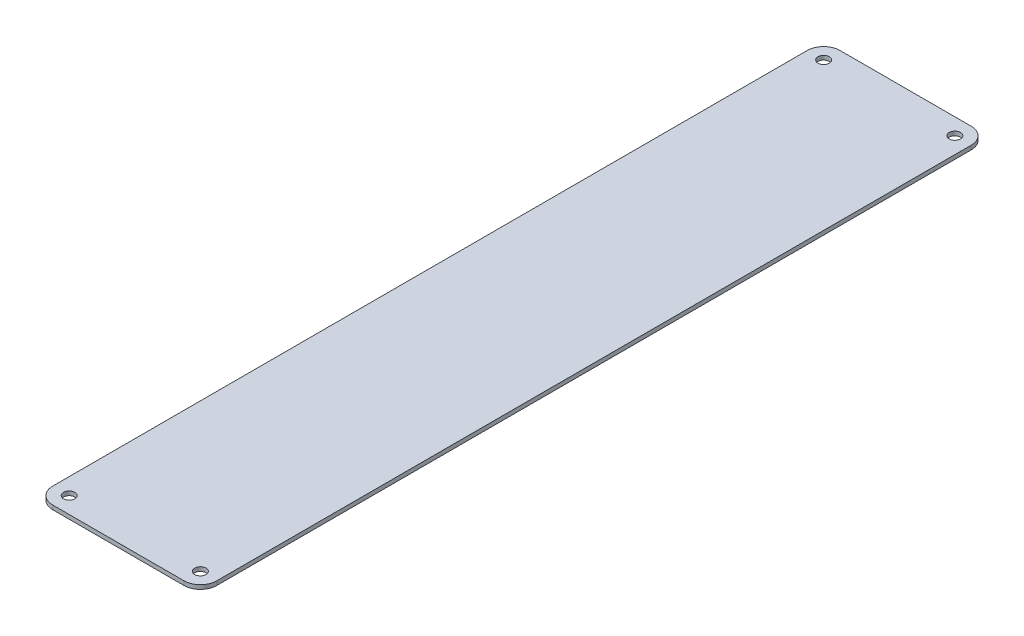
ISO-10303-21;
HEADER;
FILE_DESCRIPTION(('STEP AP214'),'2;1');
FILE_NAME('part.step','',(''),(''),'','','');
FILE_SCHEMA(('AUTOMOTIVE_DESIGN { 1 0 10303 214 1 1 1 1 }'));
ENDSEC;
DATA;
#1=APPLICATION_CONTEXT('core data for automotive mechanical design processes');
#2=APPLICATION_PROTOCOL_DEFINITION('international standard','automotive_design',2000,#1);
#3=PRODUCT_CONTEXT('',#1,'mechanical');
#4=PRODUCT('Part','Part','',(#3));
#5=PRODUCT_RELATED_PRODUCT_CATEGORY('part','',(#4));
#6=PRODUCT_DEFINITION_FORMATION('','',#4);
#7=PRODUCT_DEFINITION_CONTEXT('part definition',#1,'design');
#8=PRODUCT_DEFINITION('design','',#6,#7);
#9=PRODUCT_DEFINITION_SHAPE('','',#8);
#10=(LENGTH_UNIT() NAMED_UNIT(*) SI_UNIT(.MILLI.,.METRE.));
#11=(NAMED_UNIT(*) PLANE_ANGLE_UNIT() SI_UNIT($,.RADIAN.));
#12=(NAMED_UNIT(*) SI_UNIT($,.STERADIAN.) SOLID_ANGLE_UNIT());
#13=UNCERTAINTY_MEASURE_WITH_UNIT(LENGTH_MEASURE(1.E-05),#10,'distance_accuracy_value','');
#14=(GEOMETRIC_REPRESENTATION_CONTEXT(3) GLOBAL_UNCERTAINTY_ASSIGNED_CONTEXT((#13)) GLOBAL_UNIT_ASSIGNED_CONTEXT((#10,
#11,#12)) REPRESENTATION_CONTEXT('',''));
#15=CARTESIAN_POINT('',(0.,0.,0.));
#16=DIRECTION('',(0.,0.,1.));
#17=DIRECTION('',(1.,0.,0.));
#18=AXIS2_PLACEMENT_3D('',#15,#16,#17);
#19=CARTESIAN_POINT('',(6.35,0.79375,-298.45));
#20=DIRECTION('',(0.,1.,0.));
#21=DIRECTION('',(0.,0.,1.));
#22=AXIS2_PLACEMENT_3D('',#19,#20,#21);
#23=PLANE('',#22);
#24=CARTESIAN_POINT('',(6.35,0.79375,-6.35));
#25=DIRECTION('',(0.,1.,0.));
#26=DIRECTION('',(0.,0.,1.));
#27=AXIS2_PLACEMENT_3D('',#24,#25,#26);
#28=CIRCLE('',#27,2.1828125);
#29=CARTESIAN_POINT('',(6.35,0.79375,-4.1671875));
#30=VERTEX_POINT('',#29);
#31=EDGE_CURVE('E193',#30,#30,#28,.T.);
#32=ORIENTED_EDGE('',*,*,#31,.F.);
#33=EDGE_LOOP('',(#32));
#34=FACE_BOUND('',#33,.T.);
#35=CARTESIAN_POINT('',(57.15,0.79375,-298.45));
#36=DIRECTION('',(0.,1.,0.));
#37=DIRECTION('',(0.,0.,1.));
#38=AXIS2_PLACEMENT_3D('',#35,#36,#37);
#39=CIRCLE('',#38,2.1828125);
#40=CARTESIAN_POINT('',(57.15,0.79375,-296.2671875));
#41=VERTEX_POINT('',#40);
#42=EDGE_CURVE('E139',#41,#41,#39,.T.);
#43=ORIENTED_EDGE('',*,*,#42,.F.);
#44=EDGE_LOOP('',(#43));
#45=FACE_BOUND('',#44,.T.);
#46=CARTESIAN_POINT('',(6.35,0.79375,-298.45));
#47=DIRECTION('',(0.,1.,0.));
#48=DIRECTION('',(0.,0.,1.));
#49=AXIS2_PLACEMENT_3D('',#46,#47,#48);
#50=CIRCLE('',#49,6.35000000000001);
#51=CARTESIAN_POINT('',(6.35000000000004,0.79375,-304.8));
#52=VERTEX_POINT('',#51);
#53=CARTESIAN_POINT('',(0.,0.79375,-298.45));
#54=VERTEX_POINT('',#53);
#55=EDGE_CURVE('E150',#52,#54,#50,.T.);
#56=ORIENTED_EDGE('',*,*,#55,.T.);
#57=DIRECTION('',(0.,0.,1.));
#58=VECTOR('',#57,1.);
#59=CARTESIAN_POINT('',(0.,0.79375,-6.35000000000004));
#60=LINE('',#59,#58);
#61=CARTESIAN_POINT('',(0.,0.79375,-6.35000000000004));
#62=VERTEX_POINT('',#61);
#63=EDGE_CURVE('E98',#54,#62,#60,.T.);
#64=ORIENTED_EDGE('',*,*,#63,.T.);
#65=CARTESIAN_POINT('',(6.35,0.79375,-6.35));
#66=DIRECTION('',(0.,1.,0.));
#67=DIRECTION('',(0.,0.,-1.));
#68=AXIS2_PLACEMENT_3D('',#65,#66,#67);
#69=CIRCLE('',#68,6.35);
#70=CARTESIAN_POINT('',(6.35000000000004,0.79375,0.));
#71=VERTEX_POINT('',#70);
#72=EDGE_CURVE('E165',#62,#71,#69,.T.);
#73=ORIENTED_EDGE('',*,*,#72,.T.);
#74=DIRECTION('',(1.,0.,0.));
#75=VECTOR('',#74,1.);
#76=CARTESIAN_POINT('',(6.35000000000004,0.79375,0.));
#77=LINE('',#76,#75);
#78=CARTESIAN_POINT('',(57.15,0.79375,0.));
#79=VERTEX_POINT('',#78);
#80=EDGE_CURVE('E178',#71,#79,#77,.T.);
#81=ORIENTED_EDGE('',*,*,#80,.T.);
#82=CARTESIAN_POINT('',(57.15,0.79375,-6.35));
#83=DIRECTION('',(0.,1.,0.));
#84=DIRECTION('',(0.,0.,-1.));
#85=AXIS2_PLACEMENT_3D('',#82,#83,#84);
#86=CIRCLE('',#85,6.35);
#87=CARTESIAN_POINT('',(63.5,0.79375,-6.35000000000004));
#88=VERTEX_POINT('',#87);
#89=EDGE_CURVE('E117',#79,#88,#86,.T.);
#90=ORIENTED_EDGE('',*,*,#89,.T.);
#91=DIRECTION('',(0.,0.,-1.));
#92=VECTOR('',#91,1.);
#93=CARTESIAN_POINT('',(63.5,0.79375,-6.35000000000004));
#94=LINE('',#93,#92);
#95=CARTESIAN_POINT('',(63.5,0.79375,-298.45));
#96=VERTEX_POINT('',#95);
#97=EDGE_CURVE('E111',#88,#96,#94,.T.);
#98=ORIENTED_EDGE('',*,*,#97,.T.);
#99=CARTESIAN_POINT('',(57.15,0.79375,-298.45));
#100=DIRECTION('',(0.,1.,0.));
#101=DIRECTION('',(0.,0.,1.));
#102=AXIS2_PLACEMENT_3D('',#99,#100,#101);
#103=CIRCLE('',#102,6.35000000000001);
#104=CARTESIAN_POINT('',(57.15,0.79375,-304.8));
#105=VERTEX_POINT('',#104);
#106=EDGE_CURVE('E115',#96,#105,#103,.T.);
#107=ORIENTED_EDGE('',*,*,#106,.T.);
#108=DIRECTION('',(-1.,0.,0.));
#109=VECTOR('',#108,1.);
#110=CARTESIAN_POINT('',(6.35000000000004,0.79375,-304.8));
#111=LINE('',#110,#109);
#112=EDGE_CURVE('E55',#105,#52,#111,.T.);
#113=ORIENTED_EDGE('',*,*,#112,.T.);
#114=EDGE_LOOP('',(#56,#64,#73,#81,#90,#98,#107,#113));
#115=FACE_BOUND('',#114,.T.);
#116=CARTESIAN_POINT('',(6.35,0.79375,-298.45));
#117=DIRECTION('',(0.,1.,0.));
#118=DIRECTION('',(0.,0.,1.));
#119=AXIS2_PLACEMENT_3D('',#116,#117,#118);
#120=CIRCLE('',#119,2.1828125);
#121=CARTESIAN_POINT('',(6.35,0.79375,-296.2671875));
#122=VERTEX_POINT('',#121);
#123=EDGE_CURVE('E187',#122,#122,#120,.T.);
#124=ORIENTED_EDGE('',*,*,#123,.F.);
#125=EDGE_LOOP('',(#124));
#126=FACE_BOUND('',#125,.T.);
#127=CARTESIAN_POINT('',(57.15,0.79375,-6.35));
#128=DIRECTION('',(0.,1.,0.));
#129=DIRECTION('',(0.,0.,1.));
#130=AXIS2_PLACEMENT_3D('',#127,#128,#129);
#131=CIRCLE('',#130,2.1828125);
#132=CARTESIAN_POINT('',(57.15,0.79375,-4.1671875));
#133=VERTEX_POINT('',#132);
#134=EDGE_CURVE('E199',#133,#133,#131,.T.);
#135=ORIENTED_EDGE('',*,*,#134,.F.);
#136=EDGE_LOOP('',(#135));
#137=FACE_BOUND('',#136,.T.);
#138=ADVANCED_FACE('F38',(#34,#45,#115,#126,#137),#23,.T.);
#139=CARTESIAN_POINT('',(6.35,-0.79375,-298.45));
#140=DIRECTION('',(0.,1.,0.));
#141=DIRECTION('',(0.,0.,1.));
#142=AXIS2_PLACEMENT_3D('',#139,#140,#141);
#143=PLANE('',#142);
#144=CARTESIAN_POINT('',(6.35,-0.79375,-298.45));
#145=DIRECTION('',(0.,1.,0.));
#146=DIRECTION('',(0.,0.,1.));
#147=AXIS2_PLACEMENT_3D('',#144,#145,#146);
#148=CIRCLE('',#147,6.35000000000001);
#149=CARTESIAN_POINT('',(6.35000000000004,-0.79375,-304.8));
#150=VERTEX_POINT('',#149);
#151=CARTESIAN_POINT('',(0.,-0.79375,-298.45));
#152=VERTEX_POINT('',#151);
#153=EDGE_CURVE('E135',#150,#152,#148,.T.);
#154=ORIENTED_EDGE('',*,*,#153,.F.);
#155=DIRECTION('',(-1.,0.,0.));
#156=VECTOR('',#155,1.);
#157=CARTESIAN_POINT('',(6.35000000000004,-0.79375,-304.8));
#158=LINE('',#157,#156);
#159=CARTESIAN_POINT('',(57.15,-0.79375,-304.8));
#160=VERTEX_POINT('',#159);
#161=EDGE_CURVE('E90',#160,#150,#158,.T.);
#162=ORIENTED_EDGE('',*,*,#161,.F.);
#163=CARTESIAN_POINT('',(57.15,-0.79375,-298.45));
#164=DIRECTION('',(0.,1.,0.));
#165=DIRECTION('',(0.,0.,1.));
#166=AXIS2_PLACEMENT_3D('',#163,#164,#165);
#167=CIRCLE('',#166,6.35000000000001);
#168=CARTESIAN_POINT('',(63.5,-0.79375,-298.45));
#169=VERTEX_POINT('',#168);
#170=EDGE_CURVE('E84',#169,#160,#167,.T.);
#171=ORIENTED_EDGE('',*,*,#170,.F.);
#172=DIRECTION('',(0.,0.,-1.));
#173=VECTOR('',#172,1.);
#174=CARTESIAN_POINT('',(63.5,-0.79375,-6.35000000000004));
#175=LINE('',#174,#173);
#176=CARTESIAN_POINT('',(63.5,-0.79375,-6.35000000000004));
#177=VERTEX_POINT('',#176);
#178=EDGE_CURVE('E125',#177,#169,#175,.T.);
#179=ORIENTED_EDGE('',*,*,#178,.F.);
#180=CARTESIAN_POINT('',(57.15,-0.79375,-6.35));
#181=DIRECTION('',(0.,1.,0.));
#182=DIRECTION('',(0.,0.,-1.));
#183=AXIS2_PLACEMENT_3D('',#180,#181,#182);
#184=CIRCLE('',#183,6.35);
#185=CARTESIAN_POINT('',(57.15,-0.79375,0.));
#186=VERTEX_POINT('',#185);
#187=EDGE_CURVE('E145',#186,#177,#184,.T.);
#188=ORIENTED_EDGE('',*,*,#187,.F.);
#189=DIRECTION('',(1.,0.,0.));
#190=VECTOR('',#189,1.);
#191=CARTESIAN_POINT('',(6.35000000000004,-0.79375,0.));
#192=LINE('',#191,#190);
#193=CARTESIAN_POINT('',(6.35000000000004,-0.79375,0.));
#194=VERTEX_POINT('',#193);
#195=EDGE_CURVE('E143',#194,#186,#192,.T.);
#196=ORIENTED_EDGE('',*,*,#195,.F.);
#197=CARTESIAN_POINT('',(6.35,-0.79375,-6.35));
#198=DIRECTION('',(0.,1.,0.));
#199=DIRECTION('',(0.,0.,-1.));
#200=AXIS2_PLACEMENT_3D('',#197,#198,#199);
#201=CIRCLE('',#200,6.35);
#202=CARTESIAN_POINT('',(0.,-0.79375,-6.35000000000004));
#203=VERTEX_POINT('',#202);
#204=EDGE_CURVE('E141',#203,#194,#201,.T.);
#205=ORIENTED_EDGE('',*,*,#204,.F.);
#206=DIRECTION('',(0.,0.,1.));
#207=VECTOR('',#206,1.);
#208=CARTESIAN_POINT('',(0.,-0.79375,-6.35000000000004));
#209=LINE('',#208,#207);
#210=EDGE_CURVE('E138',#152,#203,#209,.T.);
#211=ORIENTED_EDGE('',*,*,#210,.F.);
#212=EDGE_LOOP('',(#154,#162,#171,#179,#188,#196,#205,#211));
#213=FACE_BOUND('',#212,.T.);
#214=CARTESIAN_POINT('',(57.15,-0.79375,-298.45));
#215=DIRECTION('',(0.,1.,0.));
#216=DIRECTION('',(0.,0.,1.));
#217=AXIS2_PLACEMENT_3D('',#214,#215,#216);
#218=CIRCLE('',#217,2.1828125);
#219=CARTESIAN_POINT('',(57.15,-0.79375,-296.2671875));
#220=VERTEX_POINT('',#219);
#221=EDGE_CURVE('E184',#220,#220,#218,.T.);
#222=ORIENTED_EDGE('',*,*,#221,.T.);
#223=EDGE_LOOP('',(#222));
#224=FACE_BOUND('',#223,.T.);
#225=CARTESIAN_POINT('',(6.35,-0.79375,-298.45));
#226=DIRECTION('',(0.,1.,0.));
#227=DIRECTION('',(0.,0.,1.));
#228=AXIS2_PLACEMENT_3D('',#225,#226,#227);
#229=CIRCLE('',#228,2.1828125);
#230=CARTESIAN_POINT('',(6.35,-0.79375,-296.2671875));
#231=VERTEX_POINT('',#230);
#232=EDGE_CURVE('E190',#231,#231,#229,.T.);
#233=ORIENTED_EDGE('',*,*,#232,.T.);
#234=EDGE_LOOP('',(#233));
#235=FACE_BOUND('',#234,.T.);
#236=CARTESIAN_POINT('',(6.35,-0.79375,-6.35));
#237=DIRECTION('',(0.,1.,0.));
#238=DIRECTION('',(0.,0.,1.));
#239=AXIS2_PLACEMENT_3D('',#236,#237,#238);
#240=CIRCLE('',#239,2.1828125);
#241=CARTESIAN_POINT('',(6.35,-0.79375,-4.1671875));
#242=VERTEX_POINT('',#241);
#243=EDGE_CURVE('E196',#242,#242,#240,.T.);
#244=ORIENTED_EDGE('',*,*,#243,.T.);
#245=EDGE_LOOP('',(#244));
#246=FACE_BOUND('',#245,.T.);
#247=CARTESIAN_POINT('',(57.15,-0.79375,-6.35));
#248=DIRECTION('',(0.,1.,0.));
#249=DIRECTION('',(0.,0.,1.));
#250=AXIS2_PLACEMENT_3D('',#247,#248,#249);
#251=CIRCLE('',#250,2.1828125);
#252=CARTESIAN_POINT('',(57.15,-0.79375,-4.1671875));
#253=VERTEX_POINT('',#252);
#254=EDGE_CURVE('E202',#253,#253,#251,.T.);
#255=ORIENTED_EDGE('',*,*,#254,.T.);
#256=EDGE_LOOP('',(#255));
#257=FACE_BOUND('',#256,.T.);
#258=ADVANCED_FACE('F169',(#213,#224,#235,#246,#257),#143,.F.);
#259=CARTESIAN_POINT('',(6.35,0.79375,-298.45));
#260=DIRECTION('',(0.,-1.,0.));
#261=DIRECTION('',(0.,0.,-1.));
#262=AXIS2_PLACEMENT_3D('',#259,#260,#261);
#263=CYLINDRICAL_SURFACE('',#262,6.35000000000001);
#264=ORIENTED_EDGE('',*,*,#153,.T.);
#265=DIRECTION('',(0.,-1.,0.));
#266=VECTOR('',#265,1.);
#267=CARTESIAN_POINT('',(0.,0.79375,-298.45));
#268=LINE('',#267,#266);
#269=EDGE_CURVE('E11',#54,#152,#268,.T.);
#270=ORIENTED_EDGE('',*,*,#269,.F.);
#271=ORIENTED_EDGE('',*,*,#55,.F.);
#272=DIRECTION('',(0.,-1.,0.));
#273=VECTOR('',#272,1.);
#274=CARTESIAN_POINT('',(6.35000000000004,0.79375,-304.8));
#275=LINE('',#274,#273);
#276=EDGE_CURVE('E131',#52,#150,#275,.T.);
#277=ORIENTED_EDGE('',*,*,#276,.T.);
#278=EDGE_LOOP('',(#264,#270,#271,#277));
#279=FACE_BOUND('',#278,.T.);
#280=ADVANCED_FACE('F40',(#279),#263,.T.);
#281=CARTESIAN_POINT('',(0.,0.79375,-6.35000000000004));
#282=DIRECTION('',(1.,0.,0.));
#283=DIRECTION('',(0.,0.,-1.));
#284=AXIS2_PLACEMENT_3D('',#281,#282,#283);
#285=PLANE('',#284);
#286=ORIENTED_EDGE('',*,*,#210,.T.);
#287=DIRECTION('',(0.,-1.,0.));
#288=VECTOR('',#287,1.);
#289=CARTESIAN_POINT('',(0.,0.79375,-6.35000000000004));
#290=LINE('',#289,#288);
#291=EDGE_CURVE('E47',#62,#203,#290,.T.);
#292=ORIENTED_EDGE('',*,*,#291,.F.);
#293=ORIENTED_EDGE('',*,*,#63,.F.);
#294=ORIENTED_EDGE('',*,*,#269,.T.);
#295=EDGE_LOOP('',(#286,#292,#293,#294));
#296=FACE_BOUND('',#295,.T.);
#297=ADVANCED_FACE('F236',(#296),#285,.F.);
#298=CARTESIAN_POINT('',(6.35,0.79375,-6.35));
#299=DIRECTION('',(0.,-1.,0.));
#300=DIRECTION('',(0.,0.,-1.));
#301=AXIS2_PLACEMENT_3D('',#298,#299,#300);
#302=CYLINDRICAL_SURFACE('',#301,6.35);
#303=ORIENTED_EDGE('',*,*,#204,.T.);
#304=DIRECTION('',(0.,-1.,0.));
#305=VECTOR('',#304,1.);
#306=CARTESIAN_POINT('',(6.35000000000004,0.79375,0.));
#307=LINE('',#306,#305);
#308=EDGE_CURVE('E157',#71,#194,#307,.T.);
#309=ORIENTED_EDGE('',*,*,#308,.F.);
#310=ORIENTED_EDGE('',*,*,#72,.F.);
#311=ORIENTED_EDGE('',*,*,#291,.T.);
#312=EDGE_LOOP('',(#303,#309,#310,#311));
#313=FACE_BOUND('',#312,.T.);
#314=ADVANCED_FACE('F163',(#313),#302,.T.);
#315=CARTESIAN_POINT('',(6.35000000000004,0.79375,0.));
#316=DIRECTION('',(0.,0.,-1.));
#317=DIRECTION('',(-1.,0.,0.));
#318=AXIS2_PLACEMENT_3D('',#315,#316,#317);
#319=PLANE('',#318);
#320=ORIENTED_EDGE('',*,*,#195,.T.);
#321=DIRECTION('',(0.,-1.,0.));
#322=VECTOR('',#321,1.);
#323=CARTESIAN_POINT('',(57.15,0.79375,0.));
#324=LINE('',#323,#322);
#325=EDGE_CURVE('E154',#79,#186,#324,.T.);
#326=ORIENTED_EDGE('',*,*,#325,.F.);
#327=ORIENTED_EDGE('',*,*,#80,.F.);
#328=ORIENTED_EDGE('',*,*,#308,.T.);
#329=EDGE_LOOP('',(#320,#326,#327,#328));
#330=FACE_BOUND('',#329,.T.);
#331=ADVANCED_FACE('F174',(#330),#319,.F.);
#332=CARTESIAN_POINT('',(57.15,0.79375,-6.35));
#333=DIRECTION('',(0.,-1.,0.));
#334=DIRECTION('',(0.,0.,-1.));
#335=AXIS2_PLACEMENT_3D('',#332,#333,#334);
#336=CYLINDRICAL_SURFACE('',#335,6.35);
#337=ORIENTED_EDGE('',*,*,#187,.T.);
#338=DIRECTION('',(0.,-1.,0.));
#339=VECTOR('',#338,1.);
#340=CARTESIAN_POINT('',(63.5,0.79375,-6.35000000000004));
#341=LINE('',#340,#339);
#342=EDGE_CURVE('E126',#88,#177,#341,.T.);
#343=ORIENTED_EDGE('',*,*,#342,.F.);
#344=ORIENTED_EDGE('',*,*,#89,.F.);
#345=ORIENTED_EDGE('',*,*,#325,.T.);
#346=EDGE_LOOP('',(#337,#343,#344,#345));
#347=FACE_BOUND('',#346,.T.);
#348=ADVANCED_FACE('F177',(#347),#336,.T.);
#349=CARTESIAN_POINT('',(63.5,0.79375,-6.35000000000004));
#350=DIRECTION('',(-1.,0.,0.));
#351=DIRECTION('',(0.,0.,1.));
#352=AXIS2_PLACEMENT_3D('',#349,#350,#351);
#353=PLANE('',#352);
#354=ORIENTED_EDGE('',*,*,#178,.T.);
#355=DIRECTION('',(0.,-1.,0.));
#356=VECTOR('',#355,1.);
#357=CARTESIAN_POINT('',(63.5,0.79375,-298.45));
#358=LINE('',#357,#356);
#359=EDGE_CURVE('E122',#96,#169,#358,.T.);
#360=ORIENTED_EDGE('',*,*,#359,.F.);
#361=ORIENTED_EDGE('',*,*,#97,.F.);
#362=ORIENTED_EDGE('',*,*,#342,.T.);
#363=EDGE_LOOP('',(#354,#360,#361,#362));
#364=FACE_BOUND('',#363,.T.);
#365=ADVANCED_FACE('F123',(#364),#353,.F.);
#366=CARTESIAN_POINT('',(57.15,0.79375,-298.45));
#367=DIRECTION('',(0.,-1.,0.));
#368=DIRECTION('',(0.,0.,-1.));
#369=AXIS2_PLACEMENT_3D('',#366,#367,#368);
#370=CYLINDRICAL_SURFACE('',#369,6.35000000000001);
#371=ORIENTED_EDGE('',*,*,#170,.T.);
#372=DIRECTION('',(0.,-1.,0.));
#373=VECTOR('',#372,1.);
#374=CARTESIAN_POINT('',(57.15,0.79375,-304.8));
#375=LINE('',#374,#373);
#376=EDGE_CURVE('E127',#105,#160,#375,.T.);
#377=ORIENTED_EDGE('',*,*,#376,.F.);
#378=ORIENTED_EDGE('',*,*,#106,.F.);
#379=ORIENTED_EDGE('',*,*,#359,.T.);
#380=EDGE_LOOP('',(#371,#377,#378,#379));
#381=FACE_BOUND('',#380,.T.);
#382=ADVANCED_FACE('F129',(#381),#370,.T.);
#383=CARTESIAN_POINT('',(6.35000000000004,0.79375,-304.8));
#384=DIRECTION('',(0.,0.,1.));
#385=DIRECTION('',(1.,0.,0.));
#386=AXIS2_PLACEMENT_3D('',#383,#384,#385);
#387=PLANE('',#386);
#388=ORIENTED_EDGE('',*,*,#161,.T.);
#389=ORIENTED_EDGE('',*,*,#276,.F.);
#390=ORIENTED_EDGE('',*,*,#112,.F.);
#391=ORIENTED_EDGE('',*,*,#376,.T.);
#392=EDGE_LOOP('',(#388,#389,#390,#391));
#393=FACE_BOUND('',#392,.T.);
#394=ADVANCED_FACE('F224',(#393),#387,.F.);
#395=CARTESIAN_POINT('',(57.15,0.79375,-298.45));
#396=DIRECTION('',(0.,-1.,0.));
#397=DIRECTION('',(0.,0.,-1.));
#398=AXIS2_PLACEMENT_3D('',#395,#396,#397);
#399=CYLINDRICAL_SURFACE('',#398,2.1828125);
#400=ORIENTED_EDGE('',*,*,#42,.T.);
#401=EDGE_LOOP('',(#400));
#402=FACE_BOUND('',#401,.T.);
#403=ORIENTED_EDGE('',*,*,#221,.F.);
#404=EDGE_LOOP('',(#403));
#405=FACE_BOUND('',#404,.T.);
#406=ADVANCED_FACE('F221',(#402,#405),#399,.F.);
#407=CARTESIAN_POINT('',(6.35,0.79375,-298.45));
#408=DIRECTION('',(0.,-1.,0.));
#409=DIRECTION('',(0.,0.,-1.));
#410=AXIS2_PLACEMENT_3D('',#407,#408,#409);
#411=CYLINDRICAL_SURFACE('',#410,2.1828125);
#412=ORIENTED_EDGE('',*,*,#123,.T.);
#413=EDGE_LOOP('',(#412));
#414=FACE_BOUND('',#413,.T.);
#415=ORIENTED_EDGE('',*,*,#232,.F.);
#416=EDGE_LOOP('',(#415));
#417=FACE_BOUND('',#416,.T.);
#418=ADVANCED_FACE('F300',(#414,#417),#411,.F.);
#419=CARTESIAN_POINT('',(6.35,0.79375,-6.35));
#420=DIRECTION('',(0.,-1.,0.));
#421=DIRECTION('',(0.,0.,-1.));
#422=AXIS2_PLACEMENT_3D('',#419,#420,#421);
#423=CYLINDRICAL_SURFACE('',#422,2.1828125);
#424=ORIENTED_EDGE('',*,*,#31,.T.);
#425=EDGE_LOOP('',(#424));
#426=FACE_BOUND('',#425,.T.);
#427=ORIENTED_EDGE('',*,*,#243,.F.);
#428=EDGE_LOOP('',(#427));
#429=FACE_BOUND('',#428,.T.);
#430=ADVANCED_FACE('F308',(#426,#429),#423,.F.);
#431=CARTESIAN_POINT('',(57.15,0.79375,-6.35));
#432=DIRECTION('',(0.,-1.,0.));
#433=DIRECTION('',(0.,0.,-1.));
#434=AXIS2_PLACEMENT_3D('',#431,#432,#433);
#435=CYLINDRICAL_SURFACE('',#434,2.1828125);
#436=ORIENTED_EDGE('',*,*,#134,.T.);
#437=EDGE_LOOP('',(#436));
#438=FACE_BOUND('',#437,.T.);
#439=ORIENTED_EDGE('',*,*,#254,.F.);
#440=EDGE_LOOP('',(#439));
#441=FACE_BOUND('',#440,.T.);
#442=ADVANCED_FACE('F208',(#438,#441),#435,.F.);
#443=CLOSED_SHELL('',(#138,#258,#280,#297,#314,#331,#348,#365,#382,#394,#406,#418,#430,#442));
#444=MANIFOLD_SOLID_BREP('B2',#443);
#445=ADVANCED_BREP_SHAPE_REPRESENTATION('',(#18,#444),#14);
#446=SHAPE_DEFINITION_REPRESENTATION(#9,#445);
ENDSEC;
END-ISO-10303-21;
